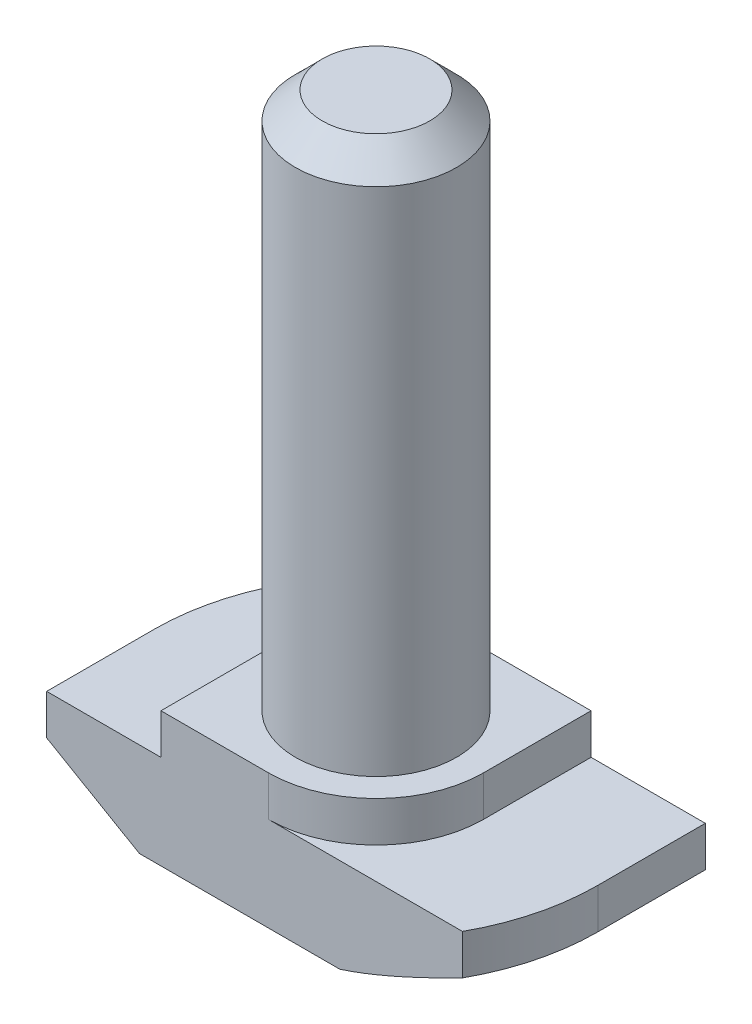
ISO-10303-21;
HEADER;
FILE_DESCRIPTION(('STEP AP214'),'2;1');
FILE_NAME('part.step','',(''),(''),'','','');
FILE_SCHEMA(('AUTOMOTIVE_DESIGN { 1 0 10303 214 1 1 1 1 }'));
ENDSEC;
DATA;
#1=APPLICATION_CONTEXT('core data for automotive mechanical design processes');
#2=APPLICATION_PROTOCOL_DEFINITION('international standard','automotive_design',2000,#1);
#3=PRODUCT_CONTEXT('',#1,'mechanical');
#4=PRODUCT('Part','Part','',(#3));
#5=PRODUCT_RELATED_PRODUCT_CATEGORY('part','',(#4));
#6=PRODUCT_DEFINITION_FORMATION('','',#4);
#7=PRODUCT_DEFINITION_CONTEXT('part definition',#1,'design');
#8=PRODUCT_DEFINITION('design','',#6,#7);
#9=PRODUCT_DEFINITION_SHAPE('','',#8);
#10=(LENGTH_UNIT() NAMED_UNIT(*) SI_UNIT(.MILLI.,.METRE.));
#11=(NAMED_UNIT(*) PLANE_ANGLE_UNIT() SI_UNIT($,.RADIAN.));
#12=(NAMED_UNIT(*) SI_UNIT($,.STERADIAN.) SOLID_ANGLE_UNIT());
#13=UNCERTAINTY_MEASURE_WITH_UNIT(LENGTH_MEASURE(1.E-05),#10,'distance_accuracy_value','');
#14=(GEOMETRIC_REPRESENTATION_CONTEXT(3) GLOBAL_UNCERTAINTY_ASSIGNED_CONTEXT((#13)) GLOBAL_UNIT_ASSIGNED_CONTEXT((#10,
#11,#12)) REPRESENTATION_CONTEXT('',''));
#15=CARTESIAN_POINT('',(0.,0.,0.));
#16=DIRECTION('',(0.,0.,1.));
#17=DIRECTION('',(1.,0.,0.));
#18=AXIS2_PLACEMENT_3D('',#15,#16,#17);
#19=CARTESIAN_POINT('',(-8.25,0.,4.));
#20=DIRECTION('',(1.,0.,0.));
#21=DIRECTION('',(0.,0.,-1.));
#22=AXIS2_PLACEMENT_3D('',#19,#20,#21);
#23=PLANE('',#22);
#24=DIRECTION('',(0.,0.,-1.));
#25=VECTOR('',#24,1.);
#26=CARTESIAN_POINT('',(-8.25,2.,4.));
#27=LINE('',#26,#25);
#28=CARTESIAN_POINT('',(-8.25,2.,4.));
#29=VERTEX_POINT('',#28);
#30=CARTESIAN_POINT('',(-8.25,2.,0.));
#31=VERTEX_POINT('',#30);
#32=EDGE_CURVE('E379',#29,#31,#27,.T.);
#33=ORIENTED_EDGE('',*,*,#32,.F.);
#34=DIRECTION('',(0.,-1.,0.));
#35=VECTOR('',#34,1.);
#36=CARTESIAN_POINT('',(-8.25,0.,4.));
#37=LINE('',#36,#35);
#38=CARTESIAN_POINT('',(-8.25,3.5,4.));
#39=VERTEX_POINT('',#38);
#40=EDGE_CURVE('E211',#39,#29,#37,.T.);
#41=ORIENTED_EDGE('',*,*,#40,.F.);
#42=DIRECTION('',(0.,0.,-1.));
#43=VECTOR('',#42,1.);
#44=CARTESIAN_POINT('',(-8.25,3.5,4.));
#45=LINE('',#44,#43);
#46=CARTESIAN_POINT('',(-8.25,3.5,0.));
#47=VERTEX_POINT('',#46);
#48=EDGE_CURVE('E226',#39,#47,#45,.T.);
#49=ORIENTED_EDGE('',*,*,#48,.T.);
#50=DIRECTION('',(0.,1.,0.));
#51=VECTOR('',#50,1.);
#52=CARTESIAN_POINT('',(-8.25,0.,0.));
#53=LINE('',#52,#51);
#54=EDGE_CURVE('E189',#31,#47,#53,.T.);
#55=ORIENTED_EDGE('',*,*,#54,.F.);
#56=EDGE_LOOP('',(#33,#41,#49,#55));
#57=FACE_BOUND('',#56,.T.);
#58=ADVANCED_FACE('F39',(#57),#23,.F.);
#59=CARTESIAN_POINT('',(8.25,0.,4.));
#60=DIRECTION('',(0.,1.,0.));
#61=DIRECTION('',(0.,0.,1.));
#62=AXIS2_PLACEMENT_3D('',#59,#60,#61);
#63=PLANE('',#62);
#64=DIRECTION('',(1.,0.,0.));
#65=VECTOR('',#64,1.);
#66=CARTESIAN_POINT('',(8.25,0.,4.));
#67=LINE('',#66,#65);
#68=CARTESIAN_POINT('',(-4.8,0.,4.));
#69=VERTEX_POINT('',#68);
#70=CARTESIAN_POINT('',(2.65329983228432,0.,4.));
#71=VERTEX_POINT('',#70);
#72=EDGE_CURVE('E214',#69,#71,#67,.T.);
#73=ORIENTED_EDGE('',*,*,#72,.F.);
#74=DIRECTION('',(0.,0.,-1.));
#75=VECTOR('',#74,1.);
#76=CARTESIAN_POINT('',(-4.8,0.,4.));
#77=LINE('',#76,#75);
#78=CARTESIAN_POINT('',(-4.8,0.,0.));
#79=VERTEX_POINT('',#78);
#80=EDGE_CURVE('E386',#69,#79,#77,.T.);
#81=ORIENTED_EDGE('',*,*,#80,.T.);
#82=CARTESIAN_POINT('',(0.,0.,0.));
#83=DIRECTION('',(0.,-1.,0.));
#84=DIRECTION('',(-1.,0.,0.));
#85=AXIS2_PLACEMENT_3D('',#82,#83,#84);
#86=CIRCLE('',#85,4.8);
#87=CARTESIAN_POINT('',(-2.65329983228432,0.,-4.));
#88=VERTEX_POINT('',#87);
#89=EDGE_CURVE('E381',#79,#88,#86,.T.);
#90=ORIENTED_EDGE('',*,*,#89,.T.);
#91=DIRECTION('',(1.,0.,0.));
#92=VECTOR('',#91,1.);
#93=CARTESIAN_POINT('',(8.25,0.,-4.));
#94=LINE('',#93,#92);
#95=CARTESIAN_POINT('',(4.80000000000001,0.,-4.));
#96=VERTEX_POINT('',#95);
#97=EDGE_CURVE('E207',#88,#96,#94,.T.);
#98=ORIENTED_EDGE('',*,*,#97,.T.);
#99=DIRECTION('',(0.,0.,1.));
#100=VECTOR('',#99,1.);
#101=CARTESIAN_POINT('',(4.8,0.,-8.25));
#102=LINE('',#101,#100);
#103=CARTESIAN_POINT('',(4.8,0.,0.));
#104=VERTEX_POINT('',#103);
#105=EDGE_CURVE('E55',#96,#104,#102,.T.);
#106=ORIENTED_EDGE('',*,*,#105,.T.);
#107=CARTESIAN_POINT('',(0.,0.,0.));
#108=DIRECTION('',(0.,-1.,0.));
#109=DIRECTION('',(1.,0.,0.));
#110=AXIS2_PLACEMENT_3D('',#107,#108,#109);
#111=CIRCLE('',#110,4.8);
#112=EDGE_CURVE('E155',#104,#71,#111,.T.);
#113=ORIENTED_EDGE('',*,*,#112,.T.);
#114=EDGE_LOOP('',(#73,#81,#90,#98,#106,#113));
#115=FACE_BOUND('',#114,.T.);
#116=ADVANCED_FACE('F272',(#115),#63,.F.);
#117=CARTESIAN_POINT('',(8.25,0.,4.));
#118=DIRECTION('',(-1.,0.,0.));
#119=DIRECTION('',(0.,0.,1.));
#120=AXIS2_PLACEMENT_3D('',#117,#118,#119);
#121=PLANE('',#120);
#122=DIRECTION('',(0.,0.,1.));
#123=VECTOR('',#122,1.);
#124=CARTESIAN_POINT('',(8.25,2.,-8.25));
#125=LINE('',#124,#123);
#126=CARTESIAN_POINT('',(8.25,2.,-4.));
#127=VERTEX_POINT('',#126);
#128=CARTESIAN_POINT('',(8.25,2.,0.));
#129=VERTEX_POINT('',#128);
#130=EDGE_CURVE('E147',#127,#129,#125,.T.);
#131=ORIENTED_EDGE('',*,*,#130,.F.);
#132=DIRECTION('',(0.,1.,0.));
#133=VECTOR('',#132,1.);
#134=CARTESIAN_POINT('',(8.25,0.,-4.));
#135=LINE('',#134,#133);
#136=CARTESIAN_POINT('',(8.25,3.5,-4.));
#137=VERTEX_POINT('',#136);
#138=EDGE_CURVE('E229',#127,#137,#135,.T.);
#139=ORIENTED_EDGE('',*,*,#138,.T.);
#140=DIRECTION('',(0.,0.,-1.));
#141=VECTOR('',#140,1.);
#142=CARTESIAN_POINT('',(8.25,3.5,4.));
#143=LINE('',#142,#141);
#144=CARTESIAN_POINT('',(8.25,3.5,0.));
#145=VERTEX_POINT('',#144);
#146=EDGE_CURVE('E175',#145,#137,#143,.T.);
#147=ORIENTED_EDGE('',*,*,#146,.F.);
#148=DIRECTION('',(0.,1.,0.));
#149=VECTOR('',#148,1.);
#150=CARTESIAN_POINT('',(8.25,0.,0.));
#151=LINE('',#150,#149);
#152=EDGE_CURVE('E168',#129,#145,#151,.T.);
#153=ORIENTED_EDGE('',*,*,#152,.F.);
#154=EDGE_LOOP('',(#131,#139,#147,#153));
#155=FACE_BOUND('',#154,.T.);
#156=ADVANCED_FACE('F173',(#155),#121,.F.);
#157=CARTESIAN_POINT('',(0.,0.,4.));
#158=DIRECTION('',(0.,0.,-1.));
#159=DIRECTION('',(-1.,0.,0.));
#160=AXIS2_PLACEMENT_3D('',#157,#158,#159);
#161=PLANE('',#160);
#162=DIRECTION('',(-0.865140001465014,0.501530435631892,0.));
#163=VECTOR('',#162,1.);
#164=CARTESIAN_POINT('',(-8.25,2.,4.));
#165=LINE('',#164,#163);
#166=EDGE_CURVE('E376',#69,#29,#165,.T.);
#167=ORIENTED_EDGE('',*,*,#166,.F.);
#168=ORIENTED_EDGE('',*,*,#72,.T.);
#169=CARTESIAN_POINT('',(7.21613484483091,2.0003549134462,4.));
#170=CARTESIAN_POINT('',(7.00803970436404,1.89487548087015,4.));
#171=CARTESIAN_POINT('',(6.79952972935955,1.79020095274389,4.));
#172=CARTESIAN_POINT('',(6.38141619995093,1.58297775175222,4.));
#173=CARTESIAN_POINT('',(6.17181247821434,1.48042941686438,4.));
#174=CARTESIAN_POINT('',(5.75012610139641,1.27743688550797,4.));
#175=CARTESIAN_POINT('',(5.53803613192248,1.17700783619689,4.));
#176=CARTESIAN_POINT('',(5.11224507719435,0.979646422001181,4.));
#177=CARTESIAN_POINT('',(4.89854408973364,0.882713846904101,4.));
#178=CARTESIAN_POINT('',(4.47468804361086,0.695863667964241,4.));
#179=CARTESIAN_POINT('',(4.26458467058549,0.605829354091029,4.));
#180=CARTESIAN_POINT('',(3.84197805474476,0.431451218393863,4.));
#181=CARTESIAN_POINT('',(3.62947448107497,0.347108192539339,4.));
#182=CARTESIAN_POINT('',(3.20203119027067,0.186199507823433,4.));
#183=CARTESIAN_POINT('',(2.98709757123852,0.109617788058737,4.));
#184=CARTESIAN_POINT('',(2.55389923857815,-0.0333694214142198,4.));
#185=CARTESIAN_POINT('',(2.335635805222,-0.0997787190081176,4.));
#186=CARTESIAN_POINT('',(1.94387785307005,-0.205950476079878,4.));
#187=CARTESIAN_POINT('',(1.77110601239678,-0.248360632646801,4.));
#188=CARTESIAN_POINT('',(1.42340457971586,-0.323102278453015,4.));
#189=CARTESIAN_POINT('',(1.24847577109918,-0.355437320952206,4.));
#190=CARTESIAN_POINT('',(0.983956924298375,-0.395158813845938,4.));
#191=CARTESIAN_POINT('',(0.895019468024547,-0.406969239956406,4.));
#192=CARTESIAN_POINT('',(0.716775216335157,-0.427377110640959,4.));
#193=CARTESIAN_POINT('',(0.627468434142931,-0.435974669258559,4.));
#194=CARTESIAN_POINT('',(0.448426860519632,-0.449809265298282,4.));
#195=CARTESIAN_POINT('',(0.358691582104533,-0.455040027620334,4.));
#196=CARTESIAN_POINT('',(0.179071951147261,-0.462030129716251,4.));
#197=CARTESIAN_POINT('',(0.0891875769025257,-0.463788909656104,4.));
#198=CARTESIAN_POINT('',(-0.00069999999999965,-0.463768080434785,4.));
#199=B_SPLINE_CURVE_WITH_KNOTS('',3,(#169,#170,#171,#172,#173,#174,#175,#176,#177,#178,#179,
#180,#181,#182,#183,#184,#185,#186,#187,#188,#189,#190,#191,#192,#193,#194,#195,#196,#197,#198),
.UNSPECIFIED.,.F.,.F.,(4,2,2,2,2,2,2,2,2,2,2,2,2,2,4),(0.,0.699911319164634,1.39993305552495,
2.10390673397942,2.80783801786106,3.49352135898838,4.1793004001725,4.86363002992971,
5.54770286235738,6.08117447291671,6.61445772685287,6.88356350314874,7.15265972639443,
7.42225605507736,7.6918958508215),.UNSPECIFIED.);
#200=CARTESIAN_POINT('',(7.21543484483091,2.,4.));
#201=VERTEX_POINT('',#200);
#202=EDGE_CURVE('E321',#201,#71,#199,.T.);
#203=ORIENTED_EDGE('',*,*,#202,.F.);
#204=DIRECTION('',(0.,1.,0.));
#205=VECTOR('',#204,1.);
#206=CARTESIAN_POINT('',(7.21543484483091,0.,4.));
#207=LINE('',#206,#205);
#208=CARTESIAN_POINT('',(7.21543484483091,3.5,4.));
#209=VERTEX_POINT('',#208);
#210=EDGE_CURVE('E170',#201,#209,#207,.T.);
#211=ORIENTED_EDGE('',*,*,#210,.T.);
#212=DIRECTION('',(-1.,0.,0.));
#213=VECTOR('',#212,1.);
#214=CARTESIAN_POINT('',(8.25,3.5,4.));
#215=LINE('',#214,#213);
#216=CARTESIAN_POINT('',(0.,3.5,4.));
#217=VERTEX_POINT('',#216);
#218=EDGE_CURVE('E218',#209,#217,#215,.T.);
#219=ORIENTED_EDGE('',*,*,#218,.T.);
#220=DIRECTION('',(0.,1.,0.));
#221=VECTOR('',#220,1.);
#222=CARTESIAN_POINT('',(0.,-2.15685424949238,4.));
#223=LINE('',#222,#221);
#224=CARTESIAN_POINT('',(0.,5.,4.));
#225=VERTEX_POINT('',#224);
#226=EDGE_CURVE('E193',#217,#225,#223,.T.);
#227=ORIENTED_EDGE('',*,*,#226,.T.);
#228=DIRECTION('',(-1.,0.,0.));
#229=VECTOR('',#228,1.);
#230=CARTESIAN_POINT('',(-4.,5.,4.));
#231=LINE('',#230,#229);
#232=CARTESIAN_POINT('',(-4.,5.,4.));
#233=VERTEX_POINT('',#232);
#234=EDGE_CURVE('E220',#225,#233,#231,.T.);
#235=ORIENTED_EDGE('',*,*,#234,.T.);
#236=DIRECTION('',(0.,-1.,0.));
#237=VECTOR('',#236,1.);
#238=CARTESIAN_POINT('',(-4.,3.5,4.));
#239=LINE('',#238,#237);
#240=CARTESIAN_POINT('',(-4.,3.5,4.));
#241=VERTEX_POINT('',#240);
#242=EDGE_CURVE('E222',#233,#241,#239,.T.);
#243=ORIENTED_EDGE('',*,*,#242,.T.);
#244=DIRECTION('',(-1.,0.,0.));
#245=VECTOR('',#244,1.);
#246=CARTESIAN_POINT('',(-8.25,3.5,4.));
#247=LINE('',#246,#245);
#248=EDGE_CURVE('E224',#241,#39,#247,.T.);
#249=ORIENTED_EDGE('',*,*,#248,.T.);
#250=ORIENTED_EDGE('',*,*,#40,.T.);
#251=EDGE_LOOP('',(#167,#168,#203,#211,#219,#227,#235,#243,#249,#250));
#252=FACE_BOUND('',#251,.T.);
#253=ADVANCED_FACE('F284',(#252),#161,.F.);
#254=CARTESIAN_POINT('',(0.,0.,-4.));
#255=DIRECTION('',(0.,0.,-1.));
#256=DIRECTION('',(-1.,0.,0.));
#257=AXIS2_PLACEMENT_3D('',#254,#255,#256);
#258=PLANE('',#257);
#259=ORIENTED_EDGE('',*,*,#97,.F.);
#260=CARTESIAN_POINT('',(0.000700000000000375,-0.463768080434785,-4.));
#261=CARTESIAN_POINT('',(-0.114358329126842,-0.463810330474809,-4.));
#262=CARTESIAN_POINT('',(-0.229406181940068,-0.460914168315143,-4.));
#263=CARTESIAN_POINT('',(-0.459176742974354,-0.449474548764103,-4.));
#264=CARTESIAN_POINT('',(-0.57389956214311,-0.440933333753936,-4.));
#265=CARTESIAN_POINT('',(-0.802392674882517,-0.418473597439302,-4.));
#266=CARTESIAN_POINT('',(-0.916164913889914,-0.404574683855251,-4.));
#267=CARTESIAN_POINT('',(-1.14299095826047,-0.371797484060063,-4.));
#268=CARTESIAN_POINT('',(-1.25604469638226,-0.352918738635892,-4.));
#269=CARTESIAN_POINT('',(-1.59163927955896,-0.289934054709893,-4.));
#270=CARTESIAN_POINT('',(-1.81295324620339,-0.2392310938484,-4.));
#271=CARTESIAN_POINT('',(-2.25206021197157,-0.123936902790817,-4.));
#272=CARTESIAN_POINT('',(-2.46984941141581,-0.0593316355484477,-4.));
#273=CARTESIAN_POINT('',(-2.88037850276595,0.0733420675422271,-4.));
#274=CARTESIAN_POINT('',(-3.07344388746432,0.140416766220987,-4.));
#275=CARTESIAN_POINT('',(-3.45719283003243,0.281096697707297,-4.));
#276=CARTESIAN_POINT('',(-3.64787603311774,0.354702890346021,-4.));
#277=CARTESIAN_POINT('',(-4.02730947884495,0.506983699161029,-4.));
#278=CARTESIAN_POINT('',(-4.21605866884565,0.585660921505602,-4.));
#279=CARTESIAN_POINT('',(-4.59187708411018,0.746935123081622,-4.));
#280=CARTESIAN_POINT('',(-4.7789462360487,0.82953227241918,-4.));
#281=CARTESIAN_POINT('',(-5.1553974190999,0.999479450573734,-4.));
#282=CARTESIAN_POINT('',(-5.34475143087342,1.08689134221783,-4.));
#283=CARTESIAN_POINT('',(-5.72226955769912,1.2642563082982,-4.));
#284=CARTESIAN_POINT('',(-5.91043363638288,1.3542094599491,-4.));
#285=CARTESIAN_POINT('',(-6.28532802201771,1.53593133899591,-4.));
#286=CARTESIAN_POINT('',(-6.4720606749939,1.62769523793753,-4.));
#287=CARTESIAN_POINT('',(-6.84468479484796,1.81287486096299,-4.));
#288=CARTESIAN_POINT('',(-7.03057633605051,1.90629043536975,-4.));
#289=CARTESIAN_POINT('',(-7.21613484483091,2.0003549134462,-4.));
#290=B_SPLINE_CURVE_WITH_KNOTS('',3,(#260,#261,#262,#263,#264,#265,#266,#267,#268,#269,#270,
#271,#272,#273,#274,#275,#276,#277,#278,#279,#280,#281,#282,#283,#284,#285,#286,#287,#288,#289),
.UNSPECIFIED.,.F.,.F.,(4,2,2,2,2,2,2,2,2,2,2,2,2,2,4),(0.,0.345120812912262,0.690104616005523,
1.03383767850813,1.37760244929378,2.05809541547289,2.73927872108519,3.35228685457644,
3.9653852219153,4.57880123256928,5.19224388693237,5.81788979165579,6.44355472673186,
7.06773117786113,7.69185135226981),.UNSPECIFIED.);
#291=CARTESIAN_POINT('',(-7.21543484483091,2.,-4.));
#292=VERTEX_POINT('',#291);
#293=EDGE_CURVE('E315',#88,#292,#290,.T.);
#294=ORIENTED_EDGE('',*,*,#293,.T.);
#295=DIRECTION('',(0.,1.,0.));
#296=VECTOR('',#295,1.);
#297=CARTESIAN_POINT('',(-7.21543484483091,0.,-4.));
#298=LINE('',#297,#296);
#299=CARTESIAN_POINT('',(-7.21543484483091,3.5,-4.));
#300=VERTEX_POINT('',#299);
#301=EDGE_CURVE('E179',#292,#300,#298,.T.);
#302=ORIENTED_EDGE('',*,*,#301,.T.);
#303=DIRECTION('',(-1.,0.,0.));
#304=VECTOR('',#303,1.);
#305=CARTESIAN_POINT('',(-8.25,3.5,-4.));
#306=LINE('',#305,#304);
#307=CARTESIAN_POINT('',(0.,3.5,-4.));
#308=VERTEX_POINT('',#307);
#309=EDGE_CURVE('E215',#308,#300,#306,.T.);
#310=ORIENTED_EDGE('',*,*,#309,.F.);
#311=DIRECTION('',(0.,1.,0.));
#312=VECTOR('',#311,1.);
#313=CARTESIAN_POINT('',(0.,-2.15685424949238,-4.));
#314=LINE('',#313,#312);
#315=CARTESIAN_POINT('',(0.,5.,-4.));
#316=VERTEX_POINT('',#315);
#317=EDGE_CURVE('E203',#308,#316,#314,.T.);
#318=ORIENTED_EDGE('',*,*,#317,.T.);
#319=DIRECTION('',(-1.,0.,0.));
#320=VECTOR('',#319,1.);
#321=CARTESIAN_POINT('',(-4.,5.,-4.));
#322=LINE('',#321,#320);
#323=CARTESIAN_POINT('',(4.,5.,-4.));
#324=VERTEX_POINT('',#323);
#325=EDGE_CURVE('E237',#324,#316,#322,.T.);
#326=ORIENTED_EDGE('',*,*,#325,.F.);
#327=DIRECTION('',(0.,1.,0.));
#328=VECTOR('',#327,1.);
#329=CARTESIAN_POINT('',(4.,3.5,-4.));
#330=LINE('',#329,#328);
#331=CARTESIAN_POINT('',(4.,3.5,-4.));
#332=VERTEX_POINT('',#331);
#333=EDGE_CURVE('E234',#332,#324,#330,.T.);
#334=ORIENTED_EDGE('',*,*,#333,.F.);
#335=DIRECTION('',(-1.,0.,0.));
#336=VECTOR('',#335,1.);
#337=CARTESIAN_POINT('',(8.25,3.5,-4.));
#338=LINE('',#337,#336);
#339=EDGE_CURVE('E231',#137,#332,#338,.T.);
#340=ORIENTED_EDGE('',*,*,#339,.F.);
#341=ORIENTED_EDGE('',*,*,#138,.F.);
#342=DIRECTION('',(-0.865140001465014,-0.501530435631892,0.));
#343=VECTOR('',#342,1.);
#344=CARTESIAN_POINT('',(1.20735733375256,-2.08269140072316,-4.));
#345=LINE('',#344,#343);
#346=EDGE_CURVE('E151',#127,#96,#345,.T.);
#347=ORIENTED_EDGE('',*,*,#346,.T.);
#348=EDGE_LOOP('',(#259,#294,#302,#310,#318,#326,#334,#340,#341,#347));
#349=FACE_BOUND('',#348,.T.);
#350=ADVANCED_FACE('F306',(#349),#258,.T.);
#351=CARTESIAN_POINT('',(0.,0.,0.));
#352=DIRECTION('',(0.,1.,0.));
#353=DIRECTION('',(0.,0.,1.));
#354=AXIS2_PLACEMENT_3D('',#351,#352,#353);
#355=CYLINDRICAL_SURFACE('',#354,8.25);
#356=CARTESIAN_POINT('',(0.,2.,0.));
#357=DIRECTION('',(0.,-1.,0.));
#358=DIRECTION('',(-1.,0.,0.));
#359=AXIS2_PLACEMENT_3D('',#356,#357,#358);
#360=CIRCLE('',#359,8.25);
#361=EDGE_CURVE('E63',#31,#292,#360,.T.);
#362=ORIENTED_EDGE('',*,*,#361,.F.);
#363=ORIENTED_EDGE('',*,*,#54,.T.);
#364=CARTESIAN_POINT('',(0.,3.5,0.));
#365=DIRECTION('',(0.,-1.,0.));
#366=DIRECTION('',(0.,0.,-1.));
#367=AXIS2_PLACEMENT_3D('',#364,#365,#366);
#368=CIRCLE('',#367,8.25);
#369=EDGE_CURVE('E176',#47,#300,#368,.T.);
#370=ORIENTED_EDGE('',*,*,#369,.T.);
#371=ORIENTED_EDGE('',*,*,#301,.F.);
#372=EDGE_LOOP('',(#362,#363,#370,#371));
#373=FACE_BOUND('',#372,.T.);
#374=ADVANCED_FACE('F310',(#373),#355,.T.);
#375=CARTESIAN_POINT('',(0.,0.,0.));
#376=DIRECTION('',(0.,1.,0.));
#377=DIRECTION('',(0.,0.,1.));
#378=AXIS2_PLACEMENT_3D('',#375,#376,#377);
#379=CYLINDRICAL_SURFACE('',#378,8.25);
#380=CARTESIAN_POINT('',(0.,2.,0.));
#381=DIRECTION('',(0.,-1.,0.));
#382=DIRECTION('',(1.,0.,0.));
#383=AXIS2_PLACEMENT_3D('',#380,#381,#382);
#384=CIRCLE('',#383,8.25);
#385=EDGE_CURVE('E160',#129,#201,#384,.T.);
#386=ORIENTED_EDGE('',*,*,#385,.F.);
#387=ORIENTED_EDGE('',*,*,#152,.T.);
#388=CARTESIAN_POINT('',(0.,3.5,0.));
#389=DIRECTION('',(0.,-1.,0.));
#390=DIRECTION('',(0.,0.,-1.));
#391=AXIS2_PLACEMENT_3D('',#388,#389,#390);
#392=CIRCLE('',#391,8.25);
#393=EDGE_CURVE('E181',#145,#209,#392,.T.);
#394=ORIENTED_EDGE('',*,*,#393,.T.);
#395=ORIENTED_EDGE('',*,*,#210,.F.);
#396=EDGE_LOOP('',(#386,#387,#394,#395));
#397=FACE_BOUND('',#396,.T.);
#398=ADVANCED_FACE('F166',(#397),#379,.T.);
#399=CARTESIAN_POINT('',(-4.,5.,4.));
#400=DIRECTION('',(0.,-1.,0.));
#401=DIRECTION('',(0.,0.,-1.));
#402=AXIS2_PLACEMENT_3D('',#399,#400,#401);
#403=PLANE('',#402);
#404=CARTESIAN_POINT('',(0.,5.,0.));
#405=DIRECTION('',(0.,1.,0.));
#406=DIRECTION('',(0.,0.,1.));
#407=AXIS2_PLACEMENT_3D('',#404,#405,#406);
#408=CIRCLE('',#407,3.);
#409=CARTESIAN_POINT('',(0.,5.,3.));
#410=VERTEX_POINT('',#409);
#411=EDGE_CURVE('E208',#410,#410,#408,.T.);
#412=ORIENTED_EDGE('',*,*,#411,.F.);
#413=EDGE_LOOP('',(#412));
#414=FACE_BOUND('',#413,.T.);
#415=ORIENTED_EDGE('',*,*,#234,.F.);
#416=CARTESIAN_POINT('',(0.,5.,0.));
#417=DIRECTION('',(0.,-1.,0.));
#418=DIRECTION('',(0.,0.,-1.));
#419=AXIS2_PLACEMENT_3D('',#416,#417,#418);
#420=CIRCLE('',#419,4.);
#421=CARTESIAN_POINT('',(4.,5.,0.));
#422=VERTEX_POINT('',#421);
#423=EDGE_CURVE('E186',#422,#225,#420,.T.);
#424=ORIENTED_EDGE('',*,*,#423,.F.);
#425=DIRECTION('',(0.,0.,-1.));
#426=VECTOR('',#425,1.);
#427=CARTESIAN_POINT('',(4.,5.,4.));
#428=LINE('',#427,#426);
#429=EDGE_CURVE('E250',#422,#324,#428,.T.);
#430=ORIENTED_EDGE('',*,*,#429,.T.);
#431=ORIENTED_EDGE('',*,*,#325,.T.);
#432=CARTESIAN_POINT('',(0.,5.,0.));
#433=DIRECTION('',(0.,-1.,0.));
#434=DIRECTION('',(0.,0.,-1.));
#435=AXIS2_PLACEMENT_3D('',#432,#433,#434);
#436=CIRCLE('',#435,4.);
#437=CARTESIAN_POINT('',(-4.,5.,0.));
#438=VERTEX_POINT('',#437);
#439=EDGE_CURVE('E197',#438,#316,#436,.T.);
#440=ORIENTED_EDGE('',*,*,#439,.F.);
#441=DIRECTION('',(0.,0.,-1.));
#442=VECTOR('',#441,1.);
#443=CARTESIAN_POINT('',(-4.,5.,4.));
#444=LINE('',#443,#442);
#445=EDGE_CURVE('E247',#233,#438,#444,.T.);
#446=ORIENTED_EDGE('',*,*,#445,.F.);
#447=EDGE_LOOP('',(#415,#424,#430,#431,#440,#446));
#448=FACE_BOUND('',#447,.T.);
#449=ADVANCED_FACE('F289',(#414,#448),#403,.F.);
#450=CARTESIAN_POINT('',(8.25,3.5,4.));
#451=DIRECTION('',(0.,-1.,0.));
#452=DIRECTION('',(0.,0.,-1.));
#453=AXIS2_PLACEMENT_3D('',#450,#451,#452);
#454=PLANE('',#453);
#455=ORIENTED_EDGE('',*,*,#218,.F.);
#456=ORIENTED_EDGE('',*,*,#393,.F.);
#457=ORIENTED_EDGE('',*,*,#146,.T.);
#458=ORIENTED_EDGE('',*,*,#339,.T.);
#459=DIRECTION('',(0.,0.,-1.));
#460=VECTOR('',#459,1.);
#461=CARTESIAN_POINT('',(4.,3.5,4.));
#462=LINE('',#461,#460);
#463=CARTESIAN_POINT('',(4.,3.5,0.));
#464=VERTEX_POINT('',#463);
#465=EDGE_CURVE('E252',#464,#332,#462,.T.);
#466=ORIENTED_EDGE('',*,*,#465,.F.);
#467=CARTESIAN_POINT('',(0.,3.5,0.));
#468=DIRECTION('',(0.,-1.,0.));
#469=DIRECTION('',(0.,0.,-1.));
#470=AXIS2_PLACEMENT_3D('',#467,#468,#469);
#471=CIRCLE('',#470,4.);
#472=EDGE_CURVE('E190',#464,#217,#471,.T.);
#473=ORIENTED_EDGE('',*,*,#472,.T.);
#474=EDGE_LOOP('',(#455,#456,#457,#458,#466,#473));
#475=FACE_BOUND('',#474,.T.);
#476=ADVANCED_FACE('F285',(#475),#454,.F.);
#477=CARTESIAN_POINT('',(4.,3.5,4.));
#478=DIRECTION('',(-1.,0.,0.));
#479=DIRECTION('',(0.,0.,1.));
#480=AXIS2_PLACEMENT_3D('',#477,#478,#479);
#481=PLANE('',#480);
#482=ORIENTED_EDGE('',*,*,#429,.F.);
#483=DIRECTION('',(0.,1.,0.));
#484=VECTOR('',#483,1.);
#485=CARTESIAN_POINT('',(4.,-2.15685424949238,0.));
#486=LINE('',#485,#484);
#487=EDGE_CURVE('E188',#464,#422,#486,.T.);
#488=ORIENTED_EDGE('',*,*,#487,.F.);
#489=ORIENTED_EDGE('',*,*,#465,.T.);
#490=ORIENTED_EDGE('',*,*,#333,.T.);
#491=EDGE_LOOP('',(#482,#488,#489,#490));
#492=FACE_BOUND('',#491,.T.);
#493=ADVANCED_FACE('F288',(#492),#481,.F.);
#494=CARTESIAN_POINT('',(-4.,3.5,4.));
#495=DIRECTION('',(1.,0.,0.));
#496=DIRECTION('',(0.,0.,-1.));
#497=AXIS2_PLACEMENT_3D('',#494,#495,#496);
#498=PLANE('',#497);
#499=ORIENTED_EDGE('',*,*,#445,.T.);
#500=DIRECTION('',(0.,1.,0.));
#501=VECTOR('',#500,1.);
#502=CARTESIAN_POINT('',(-4.,-2.15685424949238,0.));
#503=LINE('',#502,#501);
#504=CARTESIAN_POINT('',(-4.,3.5,0.));
#505=VERTEX_POINT('',#504);
#506=EDGE_CURVE('E199',#505,#438,#503,.T.);
#507=ORIENTED_EDGE('',*,*,#506,.F.);
#508=DIRECTION('',(0.,0.,-1.));
#509=VECTOR('',#508,1.);
#510=CARTESIAN_POINT('',(-4.,3.5,4.));
#511=LINE('',#510,#509);
#512=EDGE_CURVE('E244',#241,#505,#511,.T.);
#513=ORIENTED_EDGE('',*,*,#512,.F.);
#514=ORIENTED_EDGE('',*,*,#242,.F.);
#515=EDGE_LOOP('',(#499,#507,#513,#514));
#516=FACE_BOUND('',#515,.T.);
#517=ADVANCED_FACE('F293',(#516),#498,.F.);
#518=CARTESIAN_POINT('',(-8.25,3.5,4.));
#519=DIRECTION('',(0.,-1.,0.));
#520=DIRECTION('',(0.,0.,-1.));
#521=AXIS2_PLACEMENT_3D('',#518,#519,#520);
#522=PLANE('',#521);
#523=ORIENTED_EDGE('',*,*,#309,.T.);
#524=ORIENTED_EDGE('',*,*,#369,.F.);
#525=ORIENTED_EDGE('',*,*,#48,.F.);
#526=ORIENTED_EDGE('',*,*,#248,.F.);
#527=ORIENTED_EDGE('',*,*,#512,.T.);
#528=CARTESIAN_POINT('',(0.,3.5,0.));
#529=DIRECTION('',(0.,-1.,0.));
#530=DIRECTION('',(0.,0.,-1.));
#531=AXIS2_PLACEMENT_3D('',#528,#529,#530);
#532=CIRCLE('',#531,4.);
#533=EDGE_CURVE('E200',#505,#308,#532,.T.);
#534=ORIENTED_EDGE('',*,*,#533,.T.);
#535=EDGE_LOOP('',(#523,#524,#525,#526,#527,#534));
#536=FACE_BOUND('',#535,.T.);
#537=ADVANCED_FACE('F300',(#536),#522,.F.);
#538=CARTESIAN_POINT('',(0.,25.,0.));
#539=DIRECTION('',(0.,-1.,0.));
#540=DIRECTION('',(0.,0.,-1.));
#541=AXIS2_PLACEMENT_3D('',#538,#539,#540);
#542=CYLINDRICAL_SURFACE('',#541,3.);
#543=CARTESIAN_POINT('',(0.,24.,0.));
#544=DIRECTION('',(0.,1.,0.));
#545=DIRECTION('',(0.,0.,1.));
#546=AXIS2_PLACEMENT_3D('',#543,#544,#545);
#547=CIRCLE('',#546,3.);
#548=CARTESIAN_POINT('',(0.,24.,3.));
#549=VERTEX_POINT('',#548);
#550=EDGE_CURVE('E11',#549,#549,#547,.F.);
#551=ORIENTED_EDGE('',*,*,#550,.T.);
#552=EDGE_LOOP('',(#551));
#553=FACE_BOUND('',#552,.T.);
#554=ORIENTED_EDGE('',*,*,#411,.T.);
#555=EDGE_LOOP('',(#554));
#556=FACE_BOUND('',#555,.T.);
#557=ADVANCED_FACE('F304',(#553,#556),#542,.T.);
#558=CARTESIAN_POINT('',(0.,25.,0.));
#559=DIRECTION('',(0.,1.,0.));
#560=DIRECTION('',(0.,0.,1.));
#561=AXIS2_PLACEMENT_3D('',#558,#559,#560);
#562=PLANE('',#561);
#563=CARTESIAN_POINT('',(0.,25.,0.));
#564=DIRECTION('',(0.,1.,0.));
#565=DIRECTION('',(0.,0.,1.));
#566=AXIS2_PLACEMENT_3D('',#563,#564,#565);
#567=CIRCLE('',#566,2.);
#568=CARTESIAN_POINT('',(0.,25.,2.));
#569=VERTEX_POINT('',#568);
#570=EDGE_CURVE('E48',#569,#569,#567,.T.);
#571=ORIENTED_EDGE('',*,*,#570,.T.);
#572=EDGE_LOOP('',(#571));
#573=FACE_BOUND('',#572,.T.);
#574=ADVANCED_FACE('F257',(#573),#562,.T.);
#575=CARTESIAN_POINT('',(0.,-2.15685424949238,0.));
#576=DIRECTION('',(0.,1.,0.));
#577=DIRECTION('',(0.,0.,1.));
#578=AXIS2_PLACEMENT_3D('',#575,#576,#577);
#579=CYLINDRICAL_SURFACE('',#578,4.);
#580=ORIENTED_EDGE('',*,*,#506,.T.);
#581=ORIENTED_EDGE('',*,*,#439,.T.);
#582=ORIENTED_EDGE('',*,*,#317,.F.);
#583=ORIENTED_EDGE('',*,*,#533,.F.);
#584=EDGE_LOOP('',(#580,#581,#582,#583));
#585=FACE_BOUND('',#584,.T.);
#586=ADVANCED_FACE('F340',(#585),#579,.T.);
#587=CARTESIAN_POINT('',(0.,-2.15685424949238,0.));
#588=DIRECTION('',(0.,1.,0.));
#589=DIRECTION('',(0.,0.,1.));
#590=AXIS2_PLACEMENT_3D('',#587,#588,#589);
#591=CYLINDRICAL_SURFACE('',#590,4.);
#592=ORIENTED_EDGE('',*,*,#487,.T.);
#593=ORIENTED_EDGE('',*,*,#423,.T.);
#594=ORIENTED_EDGE('',*,*,#226,.F.);
#595=ORIENTED_EDGE('',*,*,#472,.F.);
#596=EDGE_LOOP('',(#592,#593,#594,#595));
#597=FACE_BOUND('',#596,.T.);
#598=ADVANCED_FACE('F337',(#597),#591,.T.);
#599=CARTESIAN_POINT('',(8.25,2.,-8.25));
#600=DIRECTION('',(0.501530435631892,-0.865140001465014,0.));
#601=DIRECTION('',(0.865140001465014,0.501530435631892,0.));
#602=AXIS2_PLACEMENT_3D('',#599,#600,#601);
#603=PLANE('',#602);
#604=ORIENTED_EDGE('',*,*,#130,.T.);
#605=DIRECTION('',(0.865140001465014,0.501530435631892,0.));
#606=VECTOR('',#605,1.);
#607=CARTESIAN_POINT('',(8.25,2.,0.));
#608=LINE('',#607,#606);
#609=EDGE_CURVE('E150',#104,#129,#608,.T.);
#610=ORIENTED_EDGE('',*,*,#609,.F.);
#611=ORIENTED_EDGE('',*,*,#105,.F.);
#612=ORIENTED_EDGE('',*,*,#346,.F.);
#613=EDGE_LOOP('',(#604,#610,#611,#612));
#614=FACE_BOUND('',#613,.T.);
#615=ADVANCED_FACE('F149',(#614),#603,.T.);
#616=CARTESIAN_POINT('',(0.,0.,0.));
#617=DIRECTION('',(0.,1.,0.));
#618=DIRECTION('',(0.,0.,1.));
#619=AXIS2_PLACEMENT_3D('',#616,#617,#618);
#620=CONICAL_SURFACE('',#619,4.8,1.04542945297958);
#621=ORIENTED_EDGE('',*,*,#202,.T.);
#622=ORIENTED_EDGE('',*,*,#112,.F.);
#623=ORIENTED_EDGE('',*,*,#609,.T.);
#624=ORIENTED_EDGE('',*,*,#385,.T.);
#625=EDGE_LOOP('',(#621,#622,#623,#624));
#626=FACE_BOUND('',#625,.T.);
#627=ADVANCED_FACE('F159',(#626),#620,.T.);
#628=CARTESIAN_POINT('',(-8.25,2.,4.));
#629=DIRECTION('',(-0.501530435631892,-0.865140001465014,0.));
#630=DIRECTION('',(0.865140001465014,-0.501530435631892,0.));
#631=AXIS2_PLACEMENT_3D('',#628,#629,#630);
#632=PLANE('',#631);
#633=ORIENTED_EDGE('',*,*,#32,.T.);
#634=DIRECTION('',(-0.865140001465014,0.501530435631892,0.));
#635=VECTOR('',#634,1.);
#636=CARTESIAN_POINT('',(-8.25,2.,0.));
#637=LINE('',#636,#635);
#638=EDGE_CURVE('E382',#79,#31,#637,.T.);
#639=ORIENTED_EDGE('',*,*,#638,.F.);
#640=ORIENTED_EDGE('',*,*,#80,.F.);
#641=ORIENTED_EDGE('',*,*,#166,.T.);
#642=EDGE_LOOP('',(#633,#639,#640,#641));
#643=FACE_BOUND('',#642,.T.);
#644=ADVANCED_FACE('F262',(#643),#632,.T.);
#645=CARTESIAN_POINT('',(0.,0.,0.));
#646=DIRECTION('',(0.,1.,0.));
#647=DIRECTION('',(0.,0.,1.));
#648=AXIS2_PLACEMENT_3D('',#645,#646,#647);
#649=CONICAL_SURFACE('',#648,4.8,1.04542945297958);
#650=ORIENTED_EDGE('',*,*,#89,.F.);
#651=ORIENTED_EDGE('',*,*,#638,.T.);
#652=ORIENTED_EDGE('',*,*,#361,.T.);
#653=ORIENTED_EDGE('',*,*,#293,.F.);
#654=EDGE_LOOP('',(#650,#651,#652,#653));
#655=FACE_BOUND('',#654,.T.);
#656=ADVANCED_FACE('F260',(#655),#649,.T.);
#657=CARTESIAN_POINT('',(0.,25.,0.));
#658=DIRECTION('',(0.,-1.,0.));
#659=DIRECTION('',(0.,0.,-1.));
#660=AXIS2_PLACEMENT_3D('',#657,#658,#659);
#661=CONICAL_SURFACE('',#660,2.,0.785398163397446);
#662=ORIENTED_EDGE('',*,*,#550,.F.);
#663=EDGE_LOOP('',(#662));
#664=FACE_BOUND('',#663,.T.);
#665=ORIENTED_EDGE('',*,*,#570,.F.);
#666=EDGE_LOOP('',(#665));
#667=FACE_BOUND('',#666,.T.);
#668=ADVANCED_FACE('F42',(#664,#667),#661,.T.);
#669=CLOSED_SHELL('',(#58,#116,#156,#253,#350,#374,#398,#449,#476,#493,#517,#537,#557,#574,#586,
#598,#615,#627,#644,#656,#668));
#670=MANIFOLD_SOLID_BREP('B2',#669);
#671=ADVANCED_BREP_SHAPE_REPRESENTATION('',(#18,#670),#14);
#672=SHAPE_DEFINITION_REPRESENTATION(#9,#671);
ENDSEC;
END-ISO-10303-21;
